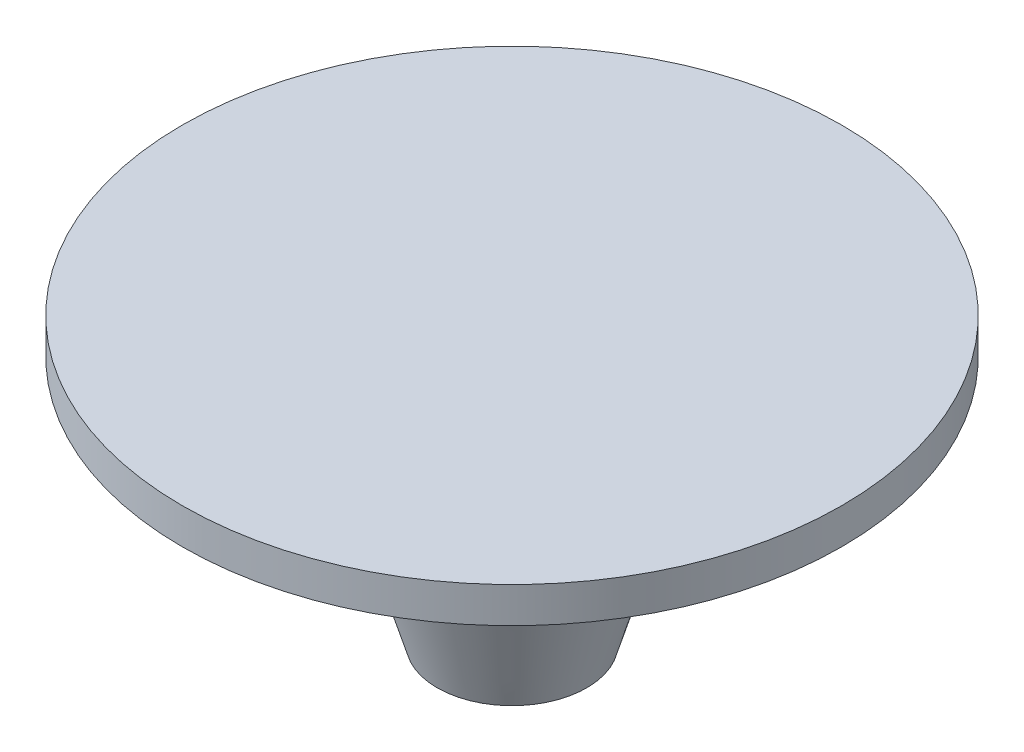
ISO-10303-21;
HEADER;
FILE_DESCRIPTION(('STEP AP214'),'2;1');
FILE_NAME('part.step','',(''),(''),'','','');
FILE_SCHEMA(('AUTOMOTIVE_DESIGN { 1 0 10303 214 1 1 1 1 }'));
ENDSEC;
DATA;
#1=APPLICATION_CONTEXT('core data for automotive mechanical design processes');
#2=APPLICATION_PROTOCOL_DEFINITION('international standard','automotive_design',2000,#1);
#3=PRODUCT_CONTEXT('',#1,'mechanical');
#4=PRODUCT('Part','Part','',(#3));
#5=PRODUCT_RELATED_PRODUCT_CATEGORY('part','',(#4));
#6=PRODUCT_DEFINITION_FORMATION('','',#4);
#7=PRODUCT_DEFINITION_CONTEXT('part definition',#1,'design');
#8=PRODUCT_DEFINITION('design','',#6,#7);
#9=PRODUCT_DEFINITION_SHAPE('','',#8);
#10=(LENGTH_UNIT() NAMED_UNIT(*) SI_UNIT(.MILLI.,.METRE.));
#11=(NAMED_UNIT(*) PLANE_ANGLE_UNIT() SI_UNIT($,.RADIAN.));
#12=(NAMED_UNIT(*) SI_UNIT($,.STERADIAN.) SOLID_ANGLE_UNIT());
#13=UNCERTAINTY_MEASURE_WITH_UNIT(LENGTH_MEASURE(1.E-05),#10,'distance_accuracy_value','');
#14=(GEOMETRIC_REPRESENTATION_CONTEXT(3) GLOBAL_UNCERTAINTY_ASSIGNED_CONTEXT((#13)) GLOBAL_UNIT_ASSIGNED_CONTEXT((#10,
#11,#12)) REPRESENTATION_CONTEXT('',''));
#15=CARTESIAN_POINT('',(0.,0.,0.));
#16=DIRECTION('',(0.,0.,1.));
#17=DIRECTION('',(1.,0.,0.));
#18=AXIS2_PLACEMENT_3D('',#15,#16,#17);
#19=CARTESIAN_POINT('',(0.,0.,0.));
#20=DIRECTION('',(0.,1.,0.));
#21=DIRECTION('',(0.,0.,1.));
#22=AXIS2_PLACEMENT_3D('',#19,#20,#21);
#23=PLANE('',#22);
#24=CARTESIAN_POINT('',(0.,0.,0.));
#25=DIRECTION('',(0.,1.,0.));
#26=DIRECTION('',(0.,0.,1.));
#27=AXIS2_PLACEMENT_3D('',#24,#25,#26);
#28=CIRCLE('',#27,9.24999999999996);
#29=CARTESIAN_POINT('',(0.,0.,9.24999999999996));
#30=VERTEX_POINT('',#29);
#31=EDGE_CURVE('E61',#30,#30,#28,.T.);
#32=ORIENTED_EDGE('',*,*,#31,.T.);
#33=EDGE_LOOP('',(#32));
#34=FACE_BOUND('',#33,.T.);
#35=ADVANCED_FACE('F37',(#34),#23,.T.);
#36=CARTESIAN_POINT('',(0.,299.544827586207,0.));
#37=DIRECTION('',(0.,1.,0.));
#38=DIRECTION('',(0.,0.,1.));
#39=AXIS2_PLACEMENT_3D('',#36,#37,#38);
#40=CYLINDRICAL_SURFACE('',#39,9.24999999999996);
#41=CARTESIAN_POINT('',(0.,-1.,0.));
#42=DIRECTION('',(0.,1.,0.));
#43=DIRECTION('',(0.,0.,1.));
#44=AXIS2_PLACEMENT_3D('',#41,#42,#43);
#45=CIRCLE('',#44,9.24999999999996);
#46=CARTESIAN_POINT('',(0.,-1.,9.24999999999996));
#47=VERTEX_POINT('',#46);
#48=EDGE_CURVE('E65',#47,#47,#45,.T.);
#49=ORIENTED_EDGE('',*,*,#48,.T.);
#50=EDGE_LOOP('',(#49));
#51=FACE_BOUND('',#50,.T.);
#52=ORIENTED_EDGE('',*,*,#31,.F.);
#53=EDGE_LOOP('',(#52));
#54=FACE_BOUND('',#53,.T.);
#55=ADVANCED_FACE('F93',(#51,#54),#40,.T.);
#56=CARTESIAN_POINT('',(-9.24999999999996,-0.999999999999999,0.));
#57=DIRECTION('',(0.,-1.,0.));
#58=DIRECTION('',(0.,0.,-1.));
#59=AXIS2_PLACEMENT_3D('',#56,#57,#58);
#60=PLANE('',#59);
#61=CARTESIAN_POINT('',(0.,-0.999999999999999,0.));
#62=DIRECTION('',(0.,-1.,0.));
#63=DIRECTION('',(0.,0.,-1.));
#64=AXIS2_PLACEMENT_3D('',#61,#62,#63);
#65=CIRCLE('',#64,2.49999999999996);
#66=CARTESIAN_POINT('',(0.,-0.999999999999999,-2.49999999999996));
#67=VERTEX_POINT('',#66);
#68=EDGE_CURVE('E10',#67,#67,#65,.F.);
#69=ORIENTED_EDGE('',*,*,#68,.T.);
#70=EDGE_LOOP('',(#69));
#71=FACE_BOUND('',#70,.T.);
#72=ORIENTED_EDGE('',*,*,#48,.F.);
#73=EDGE_LOOP('',(#72));
#74=FACE_BOUND('',#73,.T.);
#75=ADVANCED_FACE('F99',(#71,#74),#60,.T.);
#76=CARTESIAN_POINT('',(0.,299.544827586207,0.));
#77=DIRECTION('',(0.,1.,0.));
#78=DIRECTION('',(0.,0.,1.));
#79=AXIS2_PLACEMENT_3D('',#76,#77,#78);
#80=CYLINDRICAL_SURFACE('',#79,2.09999999999996);
#81=CARTESIAN_POINT('',(0.,-4.59999999999999,0.));
#82=DIRECTION('',(0.,1.,0.));
#83=DIRECTION('',(0.,0.,1.));
#84=AXIS2_PLACEMENT_3D('',#81,#82,#83);
#85=CIRCLE('',#84,2.09999999999996);
#86=CARTESIAN_POINT('',(0.,-4.59999999999999,2.09999999999996));
#87=VERTEX_POINT('',#86);
#88=EDGE_CURVE('E50',#87,#87,#85,.T.);
#89=ORIENTED_EDGE('',*,*,#88,.T.);
#90=EDGE_LOOP('',(#89));
#91=FACE_BOUND('',#90,.T.);
#92=CARTESIAN_POINT('',(0.,-1.40000000000001,0.));
#93=DIRECTION('',(0.,-1.,0.));
#94=DIRECTION('',(0.,0.,-1.));
#95=AXIS2_PLACEMENT_3D('',#92,#93,#94);
#96=CIRCLE('',#95,2.09999999999996);
#97=CARTESIAN_POINT('',(0.,-1.40000000000001,-2.09999999999996));
#98=VERTEX_POINT('',#97);
#99=EDGE_CURVE('E55',#98,#98,#96,.T.);
#100=ORIENTED_EDGE('',*,*,#99,.T.);
#101=EDGE_LOOP('',(#100));
#102=FACE_BOUND('',#101,.T.);
#103=ADVANCED_FACE('F105',(#91,#102),#80,.T.);
#104=CARTESIAN_POINT('',(-2.09999999999996,-5.,0.));
#105=DIRECTION('',(0.,1.,0.));
#106=DIRECTION('',(0.,0.,1.));
#107=AXIS2_PLACEMENT_3D('',#104,#105,#106);
#108=PLANE('',#107);
#109=CARTESIAN_POINT('',(0.,-5.,0.));
#110=DIRECTION('',(0.,1.,0.));
#111=DIRECTION('',(0.,0.,1.));
#112=AXIS2_PLACEMENT_3D('',#109,#110,#111);
#113=CIRCLE('',#112,2.49999999999996);
#114=CARTESIAN_POINT('',(0.,-5.,2.49999999999996));
#115=VERTEX_POINT('',#114);
#116=EDGE_CURVE('E45',#115,#115,#113,.F.);
#117=ORIENTED_EDGE('',*,*,#116,.T.);
#118=EDGE_LOOP('',(#117));
#119=FACE_BOUND('',#118,.T.);
#120=CARTESIAN_POINT('',(0.,-5.,0.));
#121=DIRECTION('',(0.,1.,0.));
#122=DIRECTION('',(0.,0.,1.));
#123=AXIS2_PLACEMENT_3D('',#120,#121,#122);
#124=CIRCLE('',#123,2.99999999999996);
#125=CARTESIAN_POINT('',(0.,-5.,2.99999999999996));
#126=VERTEX_POINT('',#125);
#127=EDGE_CURVE('E69',#126,#126,#124,.T.);
#128=ORIENTED_EDGE('',*,*,#127,.T.);
#129=EDGE_LOOP('',(#128));
#130=FACE_BOUND('',#129,.T.);
#131=ADVANCED_FACE('F90',(#119,#130),#108,.T.);
#132=CARTESIAN_POINT('',(0.,-5.,0.));
#133=DIRECTION('',(0.,1.,0.));
#134=DIRECTION('',(0.,0.,1.));
#135=AXIS2_PLACEMENT_3D('',#132,#133,#134);
#136=CONICAL_SURFACE('',#135,2.99999999999996,0.291456794477867);
#137=CARTESIAN_POINT('',(0.,-8.00000000000001,0.));
#138=DIRECTION('',(0.,1.,0.));
#139=DIRECTION('',(0.,0.,1.));
#140=AXIS2_PLACEMENT_3D('',#137,#138,#139);
#141=CIRCLE('',#140,2.09999999999996);
#142=CARTESIAN_POINT('',(0.,-8.00000000000001,2.09999999999996));
#143=VERTEX_POINT('',#142);
#144=EDGE_CURVE('E73',#143,#143,#141,.T.);
#145=ORIENTED_EDGE('',*,*,#144,.T.);
#146=EDGE_LOOP('',(#145));
#147=FACE_BOUND('',#146,.T.);
#148=ORIENTED_EDGE('',*,*,#127,.F.);
#149=EDGE_LOOP('',(#148));
#150=FACE_BOUND('',#149,.T.);
#151=ADVANCED_FACE('F78',(#147,#150),#136,.T.);
#152=CARTESIAN_POINT('',(-2.09999999999996,-8.,0.));
#153=DIRECTION('',(0.,-1.,0.));
#154=DIRECTION('',(0.,0.,-1.));
#155=AXIS2_PLACEMENT_3D('',#152,#153,#154);
#156=PLANE('',#155);
#157=ORIENTED_EDGE('',*,*,#144,.F.);
#158=EDGE_LOOP('',(#157));
#159=FACE_BOUND('',#158,.T.);
#160=ADVANCED_FACE('F81',(#159),#156,.T.);
#161=CARTESIAN_POINT('',(0.,-4.59999999999999,0.));
#162=DIRECTION('',(0.,1.,0.));
#163=DIRECTION('',(0.,0.,1.));
#164=AXIS2_PLACEMENT_3D('',#161,#162,#163);
#165=TOROIDAL_SURFACE('',#164,2.49999999999996,0.4);
#166=ORIENTED_EDGE('',*,*,#116,.F.);
#167=EDGE_LOOP('',(#166));
#168=FACE_BOUND('',#167,.T.);
#169=ORIENTED_EDGE('',*,*,#88,.F.);
#170=EDGE_LOOP('',(#169));
#171=FACE_BOUND('',#170,.T.);
#172=ADVANCED_FACE('F83',(#168,#171),#165,.F.);
#173=CARTESIAN_POINT('',(0.,-1.40000000000001,0.));
#174=DIRECTION('',(0.,-1.,0.));
#175=DIRECTION('',(0.,0.,-1.));
#176=AXIS2_PLACEMENT_3D('',#173,#174,#175);
#177=TOROIDAL_SURFACE('',#176,2.49999999999996,0.4);
#178=ORIENTED_EDGE('',*,*,#99,.F.);
#179=EDGE_LOOP('',(#178));
#180=FACE_BOUND('',#179,.T.);
#181=ORIENTED_EDGE('',*,*,#68,.F.);
#182=EDGE_LOOP('',(#181));
#183=FACE_BOUND('',#182,.T.);
#184=ADVANCED_FACE('F39',(#180,#183),#177,.F.);
#185=CLOSED_SHELL('',(#35,#55,#75,#103,#131,#151,#160,#172,#184));
#186=MANIFOLD_SOLID_BREP('B2',#185);
#187=ADVANCED_BREP_SHAPE_REPRESENTATION('',(#18,#186),#14);
#188=SHAPE_DEFINITION_REPRESENTATION(#9,#187);
ENDSEC;
END-ISO-10303-21;
